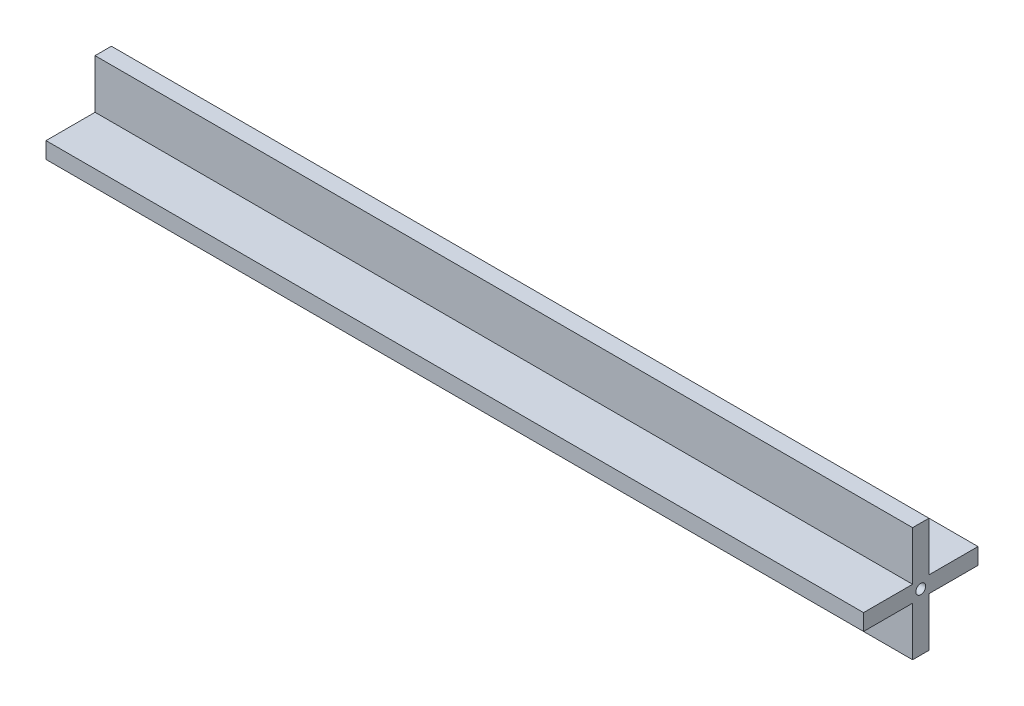
ISO-10303-21;
HEADER;
FILE_DESCRIPTION(('STEP AP214'),'2;1');
FILE_NAME('part.step','',(''),(''),'','','');
FILE_SCHEMA(('AUTOMOTIVE_DESIGN { 1 0 10303 214 1 1 1 1 }'));
ENDSEC;
DATA;
#1=APPLICATION_CONTEXT('core data for automotive mechanical design processes');
#2=APPLICATION_PROTOCOL_DEFINITION('international standard','automotive_design',2000,#1);
#3=PRODUCT_CONTEXT('',#1,'mechanical');
#4=PRODUCT('Part','Part','',(#3));
#5=PRODUCT_RELATED_PRODUCT_CATEGORY('part','',(#4));
#6=PRODUCT_DEFINITION_FORMATION('','',#4);
#7=PRODUCT_DEFINITION_CONTEXT('part definition',#1,'design');
#8=PRODUCT_DEFINITION('design','',#6,#7);
#9=PRODUCT_DEFINITION_SHAPE('','',#8);
#10=(LENGTH_UNIT() NAMED_UNIT(*) SI_UNIT(.MILLI.,.METRE.));
#11=(NAMED_UNIT(*) PLANE_ANGLE_UNIT() SI_UNIT($,.RADIAN.));
#12=(NAMED_UNIT(*) SI_UNIT($,.STERADIAN.) SOLID_ANGLE_UNIT());
#13=UNCERTAINTY_MEASURE_WITH_UNIT(LENGTH_MEASURE(1.E-05),#10,'distance_accuracy_value','');
#14=(GEOMETRIC_REPRESENTATION_CONTEXT(3) GLOBAL_UNCERTAINTY_ASSIGNED_CONTEXT((#13)) GLOBAL_UNIT_ASSIGNED_CONTEXT((#10,
#11,#12)) REPRESENTATION_CONTEXT('',''));
#15=CARTESIAN_POINT('',(0.,0.,0.));
#16=DIRECTION('',(0.,0.,1.));
#17=DIRECTION('',(1.,0.,0.));
#18=AXIS2_PLACEMENT_3D('',#15,#16,#17);
#19=CARTESIAN_POINT('',(250.,0.,0.));
#20=DIRECTION('',(-1.,0.,0.));
#21=DIRECTION('',(0.,0.,1.));
#22=AXIS2_PLACEMENT_3D('',#19,#20,#21);
#23=PLANE('',#22);
#24=DIRECTION('',(0.,1.,0.));
#25=VECTOR('',#24,1.);
#26=CARTESIAN_POINT('',(250.,17.5,-2.5));
#27=LINE('',#26,#25);
#28=CARTESIAN_POINT('',(250.,2.5,-2.5));
#29=VERTEX_POINT('',#28);
#30=CARTESIAN_POINT('',(250.,17.5,-2.5));
#31=VERTEX_POINT('',#30);
#32=EDGE_CURVE('E178',#29,#31,#27,.T.);
#33=ORIENTED_EDGE('',*,*,#32,.T.);
#34=DIRECTION('',(0.,0.,1.));
#35=VECTOR('',#34,1.);
#36=CARTESIAN_POINT('',(250.,17.5,2.5));
#37=LINE('',#36,#35);
#38=CARTESIAN_POINT('',(250.,17.5,2.5));
#39=VERTEX_POINT('',#38);
#40=EDGE_CURVE('E106',#31,#39,#37,.T.);
#41=ORIENTED_EDGE('',*,*,#40,.T.);
#42=DIRECTION('',(0.,-1.,0.));
#43=VECTOR('',#42,1.);
#44=CARTESIAN_POINT('',(250.,17.5,2.5));
#45=LINE('',#44,#43);
#46=CARTESIAN_POINT('',(250.,2.5,2.5));
#47=VERTEX_POINT('',#46);
#48=EDGE_CURVE('E205',#39,#47,#45,.T.);
#49=ORIENTED_EDGE('',*,*,#48,.T.);
#50=DIRECTION('',(0.,0.,1.));
#51=VECTOR('',#50,1.);
#52=CARTESIAN_POINT('',(250.,2.5,17.5));
#53=LINE('',#52,#51);
#54=CARTESIAN_POINT('',(250.,2.5,17.5));
#55=VERTEX_POINT('',#54);
#56=EDGE_CURVE('E224',#47,#55,#53,.T.);
#57=ORIENTED_EDGE('',*,*,#56,.T.);
#58=DIRECTION('',(0.,-1.,0.));
#59=VECTOR('',#58,1.);
#60=CARTESIAN_POINT('',(250.,-2.5,17.5));
#61=LINE('',#60,#59);
#62=CARTESIAN_POINT('',(250.,-2.5,17.5));
#63=VERTEX_POINT('',#62);
#64=EDGE_CURVE('E221',#55,#63,#61,.T.);
#65=ORIENTED_EDGE('',*,*,#64,.T.);
#66=DIRECTION('',(0.,0.,-1.));
#67=VECTOR('',#66,1.);
#68=CARTESIAN_POINT('',(250.,-2.5,17.5));
#69=LINE('',#68,#67);
#70=CARTESIAN_POINT('',(250.,-2.49999999999999,2.5));
#71=VERTEX_POINT('',#70);
#72=EDGE_CURVE('E223',#63,#71,#69,.T.);
#73=ORIENTED_EDGE('',*,*,#72,.T.);
#74=DIRECTION('',(0.,-1.,0.));
#75=VECTOR('',#74,1.);
#76=CARTESIAN_POINT('',(250.,-17.5,2.5));
#77=LINE('',#76,#75);
#78=CARTESIAN_POINT('',(250.,-17.5,2.5));
#79=VERTEX_POINT('',#78);
#80=EDGE_CURVE('E226',#71,#79,#77,.T.);
#81=ORIENTED_EDGE('',*,*,#80,.T.);
#82=DIRECTION('',(0.,0.,-1.));
#83=VECTOR('',#82,1.);
#84=CARTESIAN_POINT('',(250.,-17.5,-2.5));
#85=LINE('',#84,#83);
#86=CARTESIAN_POINT('',(250.,-17.5,-2.5));
#87=VERTEX_POINT('',#86);
#88=EDGE_CURVE('E232',#79,#87,#85,.T.);
#89=ORIENTED_EDGE('',*,*,#88,.T.);
#90=DIRECTION('',(0.,1.,0.));
#91=VECTOR('',#90,1.);
#92=CARTESIAN_POINT('',(250.,-17.5,-2.5));
#93=LINE('',#92,#91);
#94=CARTESIAN_POINT('',(250.,-2.5,-2.49999999999999));
#95=VERTEX_POINT('',#94);
#96=EDGE_CURVE('E137',#87,#95,#93,.T.);
#97=ORIENTED_EDGE('',*,*,#96,.T.);
#98=DIRECTION('',(0.,0.,-1.));
#99=VECTOR('',#98,1.);
#100=CARTESIAN_POINT('',(250.,-2.5,-17.5));
#101=LINE('',#100,#99);
#102=CARTESIAN_POINT('',(250.,-2.5,-17.5));
#103=VERTEX_POINT('',#102);
#104=EDGE_CURVE('E131',#95,#103,#101,.T.);
#105=ORIENTED_EDGE('',*,*,#104,.T.);
#106=DIRECTION('',(0.,1.,0.));
#107=VECTOR('',#106,1.);
#108=CARTESIAN_POINT('',(250.,2.5,-17.5));
#109=LINE('',#108,#107);
#110=CARTESIAN_POINT('',(250.,2.5,-17.5));
#111=VERTEX_POINT('',#110);
#112=EDGE_CURVE('E135',#103,#111,#109,.T.);
#113=ORIENTED_EDGE('',*,*,#112,.T.);
#114=DIRECTION('',(0.,0.,1.));
#115=VECTOR('',#114,1.);
#116=CARTESIAN_POINT('',(250.,2.5,-17.5));
#117=LINE('',#116,#115);
#118=EDGE_CURVE('E51',#111,#29,#117,.T.);
#119=ORIENTED_EDGE('',*,*,#118,.T.);
#120=EDGE_LOOP('',(#33,#41,#49,#57,#65,#73,#81,#89,#97,#105,#113,#119));
#121=FACE_BOUND('',#120,.T.);
#122=CARTESIAN_POINT('',(250.,0.,0.));
#123=DIRECTION('',(1.,0.,0.));
#124=DIRECTION('',(0.,0.,-1.));
#125=AXIS2_PLACEMENT_3D('',#122,#123,#124);
#126=CIRCLE('',#125,1.5);
#127=CARTESIAN_POINT('',(250.,0.,-1.5));
#128=VERTEX_POINT('',#127);
#129=EDGE_CURVE('E159',#128,#128,#126,.T.);
#130=ORIENTED_EDGE('',*,*,#129,.F.);
#131=EDGE_LOOP('',(#130));
#132=FACE_BOUND('',#131,.T.);
#133=ADVANCED_FACE('F34',(#121,#132),#23,.F.);
#134=CARTESIAN_POINT('',(0.,0.,0.));
#135=DIRECTION('',(-1.,0.,0.));
#136=DIRECTION('',(0.,0.,1.));
#137=AXIS2_PLACEMENT_3D('',#134,#135,#136);
#138=PLANE('',#137);
#139=DIRECTION('',(0.,1.,0.));
#140=VECTOR('',#139,1.);
#141=CARTESIAN_POINT('',(0.,17.5,-2.5));
#142=LINE('',#141,#140);
#143=CARTESIAN_POINT('',(0.,2.5,-2.5));
#144=VERTEX_POINT('',#143);
#145=CARTESIAN_POINT('',(0.,17.5,-2.5));
#146=VERTEX_POINT('',#145);
#147=EDGE_CURVE('E155',#144,#146,#142,.T.);
#148=ORIENTED_EDGE('',*,*,#147,.F.);
#149=DIRECTION('',(0.,0.,1.));
#150=VECTOR('',#149,1.);
#151=CARTESIAN_POINT('',(0.,2.5,-17.5));
#152=LINE('',#151,#150);
#153=CARTESIAN_POINT('',(0.,2.5,-17.5));
#154=VERTEX_POINT('',#153);
#155=EDGE_CURVE('E98',#154,#144,#152,.T.);
#156=ORIENTED_EDGE('',*,*,#155,.F.);
#157=DIRECTION('',(0.,1.,0.));
#158=VECTOR('',#157,1.);
#159=CARTESIAN_POINT('',(0.,2.5,-17.5));
#160=LINE('',#159,#158);
#161=CARTESIAN_POINT('',(0.,-2.5,-17.5));
#162=VERTEX_POINT('',#161);
#163=EDGE_CURVE('E92',#162,#154,#160,.T.);
#164=ORIENTED_EDGE('',*,*,#163,.F.);
#165=DIRECTION('',(0.,0.,-1.));
#166=VECTOR('',#165,1.);
#167=CARTESIAN_POINT('',(0.,-2.5,-17.5));
#168=LINE('',#167,#166);
#169=CARTESIAN_POINT('',(0.,-2.5,-2.49999999999999));
#170=VERTEX_POINT('',#169);
#171=EDGE_CURVE('E145',#170,#162,#168,.T.);
#172=ORIENTED_EDGE('',*,*,#171,.F.);
#173=DIRECTION('',(0.,1.,0.));
#174=VECTOR('',#173,1.);
#175=CARTESIAN_POINT('',(0.,-17.5,-2.5));
#176=LINE('',#175,#174);
#177=CARTESIAN_POINT('',(0.,-17.5,-2.5));
#178=VERTEX_POINT('',#177);
#179=EDGE_CURVE('E173',#178,#170,#176,.T.);
#180=ORIENTED_EDGE('',*,*,#179,.F.);
#181=DIRECTION('',(0.,0.,-1.));
#182=VECTOR('',#181,1.);
#183=CARTESIAN_POINT('',(0.,-17.5,-2.5));
#184=LINE('',#183,#182);
#185=CARTESIAN_POINT('',(0.,-17.5,2.5));
#186=VERTEX_POINT('',#185);
#187=EDGE_CURVE('E171',#186,#178,#184,.T.);
#188=ORIENTED_EDGE('',*,*,#187,.F.);
#189=DIRECTION('',(0.,-1.,0.));
#190=VECTOR('',#189,1.);
#191=CARTESIAN_POINT('',(0.,-17.5,2.5));
#192=LINE('',#191,#190);
#193=CARTESIAN_POINT('',(0.,-2.49999999999999,2.5));
#194=VERTEX_POINT('',#193);
#195=EDGE_CURVE('E169',#194,#186,#192,.T.);
#196=ORIENTED_EDGE('',*,*,#195,.F.);
#197=DIRECTION('',(0.,0.,-1.));
#198=VECTOR('',#197,1.);
#199=CARTESIAN_POINT('',(0.,-2.5,17.5));
#200=LINE('',#199,#198);
#201=CARTESIAN_POINT('',(0.,-2.5,17.5));
#202=VERTEX_POINT('',#201);
#203=EDGE_CURVE('E167',#202,#194,#200,.T.);
#204=ORIENTED_EDGE('',*,*,#203,.F.);
#205=DIRECTION('',(0.,-1.,0.));
#206=VECTOR('',#205,1.);
#207=CARTESIAN_POINT('',(0.,-2.5,17.5));
#208=LINE('',#207,#206);
#209=CARTESIAN_POINT('',(0.,2.5,17.5));
#210=VERTEX_POINT('',#209);
#211=EDGE_CURVE('E165',#210,#202,#208,.T.);
#212=ORIENTED_EDGE('',*,*,#211,.F.);
#213=DIRECTION('',(0.,0.,1.));
#214=VECTOR('',#213,1.);
#215=CARTESIAN_POINT('',(0.,2.5,17.5));
#216=LINE('',#215,#214);
#217=CARTESIAN_POINT('',(0.,2.5,2.5));
#218=VERTEX_POINT('',#217);
#219=EDGE_CURVE('E163',#218,#210,#216,.T.);
#220=ORIENTED_EDGE('',*,*,#219,.F.);
#221=DIRECTION('',(0.,-1.,0.));
#222=VECTOR('',#221,1.);
#223=CARTESIAN_POINT('',(0.,17.5,2.5));
#224=LINE('',#223,#222);
#225=CARTESIAN_POINT('',(0.,17.5,2.5));
#226=VERTEX_POINT('',#225);
#227=EDGE_CURVE('E161',#226,#218,#224,.T.);
#228=ORIENTED_EDGE('',*,*,#227,.F.);
#229=DIRECTION('',(0.,0.,1.));
#230=VECTOR('',#229,1.);
#231=CARTESIAN_POINT('',(0.,17.5,2.5));
#232=LINE('',#231,#230);
#233=EDGE_CURVE('E158',#146,#226,#232,.T.);
#234=ORIENTED_EDGE('',*,*,#233,.F.);
#235=EDGE_LOOP('',(#148,#156,#164,#172,#180,#188,#196,#204,#212,#220,#228,#234));
#236=FACE_BOUND('',#235,.T.);
#237=CARTESIAN_POINT('',(0.,0.,0.));
#238=DIRECTION('',(1.,0.,0.));
#239=DIRECTION('',(0.,0.,-1.));
#240=AXIS2_PLACEMENT_3D('',#237,#238,#239);
#241=CIRCLE('',#240,1.5);
#242=CARTESIAN_POINT('',(0.,0.,-1.5));
#243=VERTEX_POINT('',#242);
#244=EDGE_CURVE('E379',#243,#243,#241,.T.);
#245=ORIENTED_EDGE('',*,*,#244,.T.);
#246=EDGE_LOOP('',(#245));
#247=FACE_BOUND('',#246,.T.);
#248=ADVANCED_FACE('F209',(#236,#247),#138,.T.);
#249=CARTESIAN_POINT('',(250.,17.5,-2.5));
#250=DIRECTION('',(0.,0.,1.));
#251=DIRECTION('',(0.,-1.,0.));
#252=AXIS2_PLACEMENT_3D('',#249,#250,#251);
#253=PLANE('',#252);
#254=ORIENTED_EDGE('',*,*,#147,.T.);
#255=DIRECTION('',(-1.,0.,0.));
#256=VECTOR('',#255,1.);
#257=CARTESIAN_POINT('',(250.,17.5,-2.5));
#258=LINE('',#257,#256);
#259=EDGE_CURVE('E11',#31,#146,#258,.T.);
#260=ORIENTED_EDGE('',*,*,#259,.F.);
#261=ORIENTED_EDGE('',*,*,#32,.F.);
#262=DIRECTION('',(-1.,0.,0.));
#263=VECTOR('',#262,1.);
#264=CARTESIAN_POINT('',(250.,2.5,-2.5));
#265=LINE('',#264,#263);
#266=EDGE_CURVE('E151',#29,#144,#265,.T.);
#267=ORIENTED_EDGE('',*,*,#266,.T.);
#268=EDGE_LOOP('',(#254,#260,#261,#267));
#269=FACE_BOUND('',#268,.T.);
#270=ADVANCED_FACE('F36',(#269),#253,.F.);
#271=CARTESIAN_POINT('',(250.,17.5,2.5));
#272=DIRECTION('',(0.,-1.,0.));
#273=DIRECTION('',(0.,0.,-1.));
#274=AXIS2_PLACEMENT_3D('',#271,#272,#273);
#275=PLANE('',#274);
#276=ORIENTED_EDGE('',*,*,#233,.T.);
#277=DIRECTION('',(-1.,0.,0.));
#278=VECTOR('',#277,1.);
#279=CARTESIAN_POINT('',(250.,17.5,2.5));
#280=LINE('',#279,#278);
#281=EDGE_CURVE('E43',#39,#226,#280,.T.);
#282=ORIENTED_EDGE('',*,*,#281,.F.);
#283=ORIENTED_EDGE('',*,*,#40,.F.);
#284=ORIENTED_EDGE('',*,*,#259,.T.);
#285=EDGE_LOOP('',(#276,#282,#283,#284));
#286=FACE_BOUND('',#285,.T.);
#287=ADVANCED_FACE('F266',(#286),#275,.F.);
#288=CARTESIAN_POINT('',(250.,17.5,2.5));
#289=DIRECTION('',(0.,0.,-1.));
#290=DIRECTION('',(-1.,0.,0.));
#291=AXIS2_PLACEMENT_3D('',#288,#289,#290);
#292=PLANE('',#291);
#293=ORIENTED_EDGE('',*,*,#227,.T.);
#294=DIRECTION('',(-1.,0.,0.));
#295=VECTOR('',#294,1.);
#296=CARTESIAN_POINT('',(250.,2.5,2.5));
#297=LINE('',#296,#295);
#298=EDGE_CURVE('E197',#47,#218,#297,.T.);
#299=ORIENTED_EDGE('',*,*,#298,.F.);
#300=ORIENTED_EDGE('',*,*,#48,.F.);
#301=ORIENTED_EDGE('',*,*,#281,.T.);
#302=EDGE_LOOP('',(#293,#299,#300,#301));
#303=FACE_BOUND('',#302,.T.);
#304=ADVANCED_FACE('F203',(#303),#292,.F.);
#305=CARTESIAN_POINT('',(250.,2.5,17.5));
#306=DIRECTION('',(0.,-1.,0.));
#307=DIRECTION('',(0.,0.,-1.));
#308=AXIS2_PLACEMENT_3D('',#305,#306,#307);
#309=PLANE('',#308);
#310=ORIENTED_EDGE('',*,*,#219,.T.);
#311=DIRECTION('',(-1.,0.,0.));
#312=VECTOR('',#311,1.);
#313=CARTESIAN_POINT('',(250.,2.5,17.5));
#314=LINE('',#313,#312);
#315=EDGE_CURVE('E194',#55,#210,#314,.T.);
#316=ORIENTED_EDGE('',*,*,#315,.F.);
#317=ORIENTED_EDGE('',*,*,#56,.F.);
#318=ORIENTED_EDGE('',*,*,#298,.T.);
#319=EDGE_LOOP('',(#310,#316,#317,#318));
#320=FACE_BOUND('',#319,.T.);
#321=ADVANCED_FACE('F215',(#320),#309,.F.);
#322=CARTESIAN_POINT('',(250.,-2.5,17.5));
#323=DIRECTION('',(0.,0.,-1.));
#324=DIRECTION('',(0.,1.,0.));
#325=AXIS2_PLACEMENT_3D('',#322,#323,#324);
#326=PLANE('',#325);
#327=ORIENTED_EDGE('',*,*,#211,.T.);
#328=DIRECTION('',(-1.,0.,0.));
#329=VECTOR('',#328,1.);
#330=CARTESIAN_POINT('',(250.,-2.5,17.5));
#331=LINE('',#330,#329);
#332=EDGE_CURVE('E191',#63,#202,#331,.T.);
#333=ORIENTED_EDGE('',*,*,#332,.F.);
#334=ORIENTED_EDGE('',*,*,#64,.F.);
#335=ORIENTED_EDGE('',*,*,#315,.T.);
#336=EDGE_LOOP('',(#327,#333,#334,#335));
#337=FACE_BOUND('',#336,.T.);
#338=ADVANCED_FACE('F219',(#337),#326,.F.);
#339=CARTESIAN_POINT('',(250.,-2.5,17.5));
#340=DIRECTION('',(0.,1.,0.));
#341=DIRECTION('',(0.,0.,1.));
#342=AXIS2_PLACEMENT_3D('',#339,#340,#341);
#343=PLANE('',#342);
#344=ORIENTED_EDGE('',*,*,#203,.T.);
#345=DIRECTION('',(-1.,0.,0.));
#346=VECTOR('',#345,1.);
#347=CARTESIAN_POINT('',(250.,-2.49999999999999,2.5));
#348=LINE('',#347,#346);
#349=EDGE_CURVE('E188',#71,#194,#348,.T.);
#350=ORIENTED_EDGE('',*,*,#349,.F.);
#351=ORIENTED_EDGE('',*,*,#72,.F.);
#352=ORIENTED_EDGE('',*,*,#332,.T.);
#353=EDGE_LOOP('',(#344,#350,#351,#352));
#354=FACE_BOUND('',#353,.T.);
#355=ADVANCED_FACE('F279',(#354),#343,.F.);
#356=CARTESIAN_POINT('',(250.,-17.5,2.5));
#357=DIRECTION('',(0.,0.,-1.));
#358=DIRECTION('',(0.,1.,0.));
#359=AXIS2_PLACEMENT_3D('',#356,#357,#358);
#360=PLANE('',#359);
#361=ORIENTED_EDGE('',*,*,#195,.T.);
#362=DIRECTION('',(-1.,0.,0.));
#363=VECTOR('',#362,1.);
#364=CARTESIAN_POINT('',(250.,-17.5,2.5));
#365=LINE('',#364,#363);
#366=EDGE_CURVE('E185',#79,#186,#365,.T.);
#367=ORIENTED_EDGE('',*,*,#366,.F.);
#368=ORIENTED_EDGE('',*,*,#80,.F.);
#369=ORIENTED_EDGE('',*,*,#349,.T.);
#370=EDGE_LOOP('',(#361,#367,#368,#369));
#371=FACE_BOUND('',#370,.T.);
#372=ADVANCED_FACE('F282',(#371),#360,.F.);
#373=CARTESIAN_POINT('',(250.,-17.5,-2.5));
#374=DIRECTION('',(0.,1.,0.));
#375=DIRECTION('',(0.,0.,1.));
#376=AXIS2_PLACEMENT_3D('',#373,#374,#375);
#377=PLANE('',#376);
#378=ORIENTED_EDGE('',*,*,#187,.T.);
#379=DIRECTION('',(-1.,0.,0.));
#380=VECTOR('',#379,1.);
#381=CARTESIAN_POINT('',(250.,-17.5,-2.5));
#382=LINE('',#381,#380);
#383=EDGE_CURVE('E182',#87,#178,#382,.T.);
#384=ORIENTED_EDGE('',*,*,#383,.F.);
#385=ORIENTED_EDGE('',*,*,#88,.F.);
#386=ORIENTED_EDGE('',*,*,#366,.T.);
#387=EDGE_LOOP('',(#378,#384,#385,#386));
#388=FACE_BOUND('',#387,.T.);
#389=ADVANCED_FACE('F238',(#388),#377,.F.);
#390=CARTESIAN_POINT('',(250.,-17.5,-2.5));
#391=DIRECTION('',(0.,0.,1.));
#392=DIRECTION('',(0.,-1.,0.));
#393=AXIS2_PLACEMENT_3D('',#390,#391,#392);
#394=PLANE('',#393);
#395=ORIENTED_EDGE('',*,*,#179,.T.);
#396=DIRECTION('',(-1.,0.,0.));
#397=VECTOR('',#396,1.);
#398=CARTESIAN_POINT('',(250.,-2.5,-2.49999999999999));
#399=LINE('',#398,#397);
#400=EDGE_CURVE('E146',#95,#170,#399,.T.);
#401=ORIENTED_EDGE('',*,*,#400,.F.);
#402=ORIENTED_EDGE('',*,*,#96,.F.);
#403=ORIENTED_EDGE('',*,*,#383,.T.);
#404=EDGE_LOOP('',(#395,#401,#402,#403));
#405=FACE_BOUND('',#404,.T.);
#406=ADVANCED_FACE('F242',(#405),#394,.F.);
#407=CARTESIAN_POINT('',(250.,-2.5,-17.5));
#408=DIRECTION('',(0.,1.,0.));
#409=DIRECTION('',(0.,0.,1.));
#410=AXIS2_PLACEMENT_3D('',#407,#408,#409);
#411=PLANE('',#410);
#412=ORIENTED_EDGE('',*,*,#171,.T.);
#413=DIRECTION('',(-1.,0.,0.));
#414=VECTOR('',#413,1.);
#415=CARTESIAN_POINT('',(250.,-2.5,-17.5));
#416=LINE('',#415,#414);
#417=EDGE_CURVE('E142',#103,#162,#416,.T.);
#418=ORIENTED_EDGE('',*,*,#417,.F.);
#419=ORIENTED_EDGE('',*,*,#104,.F.);
#420=ORIENTED_EDGE('',*,*,#400,.T.);
#421=EDGE_LOOP('',(#412,#418,#419,#420));
#422=FACE_BOUND('',#421,.T.);
#423=ADVANCED_FACE('F143',(#422),#411,.F.);
#424=CARTESIAN_POINT('',(250.,2.5,-17.5));
#425=DIRECTION('',(0.,0.,1.));
#426=DIRECTION('',(1.,0.,0.));
#427=AXIS2_PLACEMENT_3D('',#424,#425,#426);
#428=PLANE('',#427);
#429=ORIENTED_EDGE('',*,*,#163,.T.);
#430=DIRECTION('',(-1.,0.,0.));
#431=VECTOR('',#430,1.);
#432=CARTESIAN_POINT('',(250.,2.5,-17.5));
#433=LINE('',#432,#431);
#434=EDGE_CURVE('E147',#111,#154,#433,.T.);
#435=ORIENTED_EDGE('',*,*,#434,.F.);
#436=ORIENTED_EDGE('',*,*,#112,.F.);
#437=ORIENTED_EDGE('',*,*,#417,.T.);
#438=EDGE_LOOP('',(#429,#435,#436,#437));
#439=FACE_BOUND('',#438,.T.);
#440=ADVANCED_FACE('F149',(#439),#428,.F.);
#441=CARTESIAN_POINT('',(250.,2.5,-17.5));
#442=DIRECTION('',(0.,-1.,0.));
#443=DIRECTION('',(0.,0.,-1.));
#444=AXIS2_PLACEMENT_3D('',#441,#442,#443);
#445=PLANE('',#444);
#446=ORIENTED_EDGE('',*,*,#155,.T.);
#447=ORIENTED_EDGE('',*,*,#266,.F.);
#448=ORIENTED_EDGE('',*,*,#118,.F.);
#449=ORIENTED_EDGE('',*,*,#434,.T.);
#450=EDGE_LOOP('',(#446,#447,#448,#449));
#451=FACE_BOUND('',#450,.T.);
#452=ADVANCED_FACE('F246',(#451),#445,.F.);
#453=CARTESIAN_POINT('',(250.,0.,0.));
#454=DIRECTION('',(-1.,0.,0.));
#455=DIRECTION('',(0.,0.,1.));
#456=AXIS2_PLACEMENT_3D('',#453,#454,#455);
#457=CYLINDRICAL_SURFACE('',#456,1.5);
#458=ORIENTED_EDGE('',*,*,#129,.T.);
#459=EDGE_LOOP('',(#458));
#460=FACE_BOUND('',#459,.T.);
#461=ORIENTED_EDGE('',*,*,#244,.F.);
#462=EDGE_LOOP('',(#461));
#463=FACE_BOUND('',#462,.T.);
#464=ADVANCED_FACE('F248',(#460,#463),#457,.F.);
#465=CLOSED_SHELL('',(#133,#248,#270,#287,#304,#321,#338,#355,#372,#389,#406,#423,#440,#452,#464));
#466=MANIFOLD_SOLID_BREP('B2',#465);
#467=ADVANCED_BREP_SHAPE_REPRESENTATION('',(#18,#466),#14);
#468=SHAPE_DEFINITION_REPRESENTATION(#9,#467);
ENDSEC;
END-ISO-10303-21;
